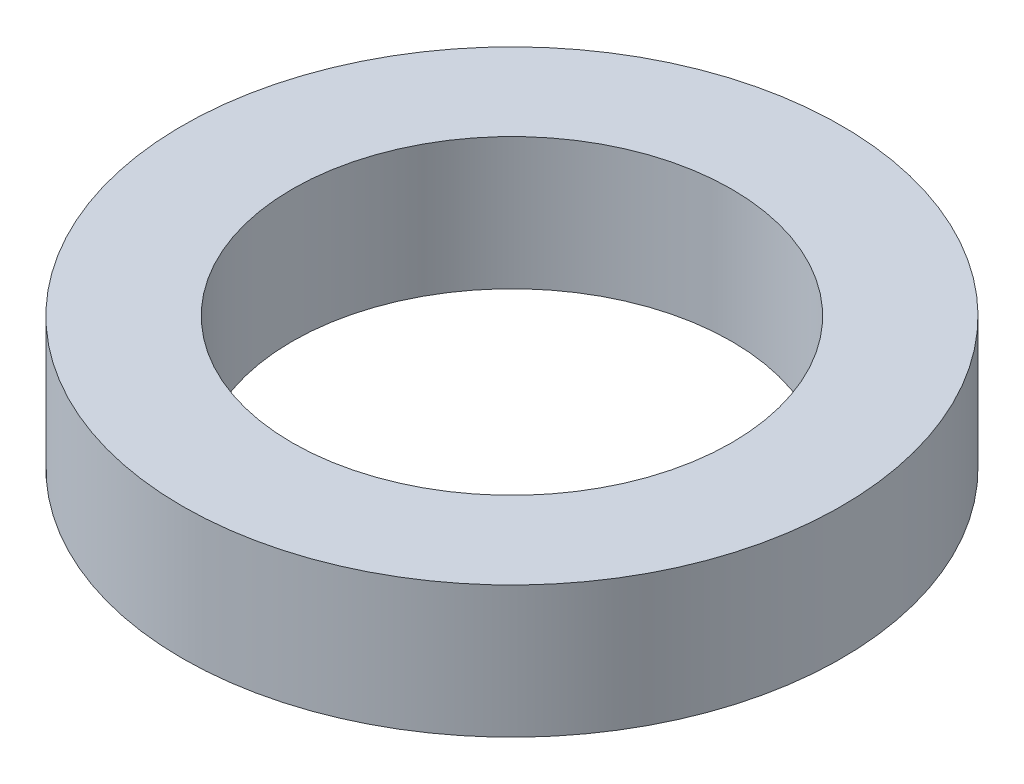
ISO-10303-21;
HEADER;
FILE_DESCRIPTION(('STEP AP214'),'2;1');
FILE_NAME('part.step','',(''),(''),'','','');
FILE_SCHEMA(('AUTOMOTIVE_DESIGN { 1 0 10303 214 1 1 1 1 }'));
ENDSEC;
DATA;
#1=APPLICATION_CONTEXT('core data for automotive mechanical design processes');
#2=APPLICATION_PROTOCOL_DEFINITION('international standard','automotive_design',2000,#1);
#3=PRODUCT_CONTEXT('',#1,'mechanical');
#4=PRODUCT('Part','Part','',(#3));
#5=PRODUCT_RELATED_PRODUCT_CATEGORY('part','',(#4));
#6=PRODUCT_DEFINITION_FORMATION('','',#4);
#7=PRODUCT_DEFINITION_CONTEXT('part definition',#1,'design');
#8=PRODUCT_DEFINITION('design','',#6,#7);
#9=PRODUCT_DEFINITION_SHAPE('','',#8);
#10=(LENGTH_UNIT() NAMED_UNIT(*) SI_UNIT(.MILLI.,.METRE.));
#11=(NAMED_UNIT(*) PLANE_ANGLE_UNIT() SI_UNIT($,.RADIAN.));
#12=(NAMED_UNIT(*) SI_UNIT($,.STERADIAN.) SOLID_ANGLE_UNIT());
#13=UNCERTAINTY_MEASURE_WITH_UNIT(LENGTH_MEASURE(1.E-05),#10,'distance_accuracy_value','');
#14=(GEOMETRIC_REPRESENTATION_CONTEXT(3) GLOBAL_UNCERTAINTY_ASSIGNED_CONTEXT((#13)) GLOBAL_UNIT_ASSIGNED_CONTEXT((#10,
#11,#12)) REPRESENTATION_CONTEXT('',''));
#15=CARTESIAN_POINT('',(0.,0.,0.));
#16=DIRECTION('',(0.,0.,1.));
#17=DIRECTION('',(1.,0.,0.));
#18=AXIS2_PLACEMENT_3D('',#15,#16,#17);
#19=CARTESIAN_POINT('',(0.,3.,0.));
#20=DIRECTION('',(0.,1.,0.));
#21=DIRECTION('',(0.,0.,1.));
#22=AXIS2_PLACEMENT_3D('',#19,#20,#21);
#23=PLANE('',#22);
#24=CARTESIAN_POINT('',(0.,3.,0.));
#25=DIRECTION('',(0.,1.,0.));
#26=DIRECTION('',(0.,0.,1.));
#27=AXIS2_PLACEMENT_3D('',#24,#25,#26);
#28=CIRCLE('',#27,7.5);
#29=CARTESIAN_POINT('',(0.,3.,7.5));
#30=VERTEX_POINT('',#29);
#31=EDGE_CURVE('E10',#30,#30,#28,.T.);
#32=ORIENTED_EDGE('',*,*,#31,.T.);
#33=EDGE_LOOP('',(#32));
#34=FACE_BOUND('',#33,.T.);
#35=CARTESIAN_POINT('',(0.,3.,0.));
#36=DIRECTION('',(0.,1.,0.));
#37=DIRECTION('',(0.,0.,1.));
#38=AXIS2_PLACEMENT_3D('',#35,#36,#37);
#39=CIRCLE('',#38,5.);
#40=CARTESIAN_POINT('',(0.,3.,5.));
#41=VERTEX_POINT('',#40);
#42=EDGE_CURVE('E42',#41,#41,#39,.T.);
#43=ORIENTED_EDGE('',*,*,#42,.F.);
#44=EDGE_LOOP('',(#43));
#45=FACE_BOUND('',#44,.T.);
#46=ADVANCED_FACE('F31',(#34,#45),#23,.T.);
#47=CARTESIAN_POINT('',(0.,0.,0.));
#48=DIRECTION('',(0.,1.,0.));
#49=DIRECTION('',(0.,0.,1.));
#50=AXIS2_PLACEMENT_3D('',#47,#48,#49);
#51=PLANE('',#50);
#52=CARTESIAN_POINT('',(0.,0.,0.));
#53=DIRECTION('',(0.,1.,0.));
#54=DIRECTION('',(0.,0.,1.));
#55=AXIS2_PLACEMENT_3D('',#52,#53,#54);
#56=CIRCLE('',#55,7.5);
#57=CARTESIAN_POINT('',(0.,0.,7.5));
#58=VERTEX_POINT('',#57);
#59=EDGE_CURVE('E35',#58,#58,#56,.T.);
#60=ORIENTED_EDGE('',*,*,#59,.F.);
#61=EDGE_LOOP('',(#60));
#62=FACE_BOUND('',#61,.T.);
#63=CARTESIAN_POINT('',(0.,0.,0.));
#64=DIRECTION('',(0.,1.,0.));
#65=DIRECTION('',(0.,0.,1.));
#66=AXIS2_PLACEMENT_3D('',#63,#64,#65);
#67=CIRCLE('',#66,5.);
#68=CARTESIAN_POINT('',(0.,0.,5.));
#69=VERTEX_POINT('',#68);
#70=EDGE_CURVE('E44',#69,#69,#67,.T.);
#71=ORIENTED_EDGE('',*,*,#70,.T.);
#72=EDGE_LOOP('',(#71));
#73=FACE_BOUND('',#72,.T.);
#74=ADVANCED_FACE('F54',(#62,#73),#51,.F.);
#75=CARTESIAN_POINT('',(0.,3.,0.));
#76=DIRECTION('',(0.,-1.,0.));
#77=DIRECTION('',(0.,0.,-1.));
#78=AXIS2_PLACEMENT_3D('',#75,#76,#77);
#79=CYLINDRICAL_SURFACE('',#78,7.5);
#80=ORIENTED_EDGE('',*,*,#31,.F.);
#81=EDGE_LOOP('',(#80));
#82=FACE_BOUND('',#81,.T.);
#83=ORIENTED_EDGE('',*,*,#59,.T.);
#84=EDGE_LOOP('',(#83));
#85=FACE_BOUND('',#84,.T.);
#86=ADVANCED_FACE('F33',(#82,#85),#79,.T.);
#87=CARTESIAN_POINT('',(0.,3.,0.));
#88=DIRECTION('',(0.,-1.,0.));
#89=DIRECTION('',(0.,0.,-1.));
#90=AXIS2_PLACEMENT_3D('',#87,#88,#89);
#91=CYLINDRICAL_SURFACE('',#90,5.);
#92=ORIENTED_EDGE('',*,*,#42,.T.);
#93=EDGE_LOOP('',(#92));
#94=FACE_BOUND('',#93,.T.);
#95=ORIENTED_EDGE('',*,*,#70,.F.);
#96=EDGE_LOOP('',(#95));
#97=FACE_BOUND('',#96,.T.);
#98=ADVANCED_FACE('F50',(#94,#97),#91,.F.);
#99=CLOSED_SHELL('',(#46,#74,#86,#98));
#100=MANIFOLD_SOLID_BREP('B2',#99);
#101=ADVANCED_BREP_SHAPE_REPRESENTATION('',(#18,#100),#14);
#102=SHAPE_DEFINITION_REPRESENTATION(#9,#101);
ENDSEC;
END-ISO-10303-21;
